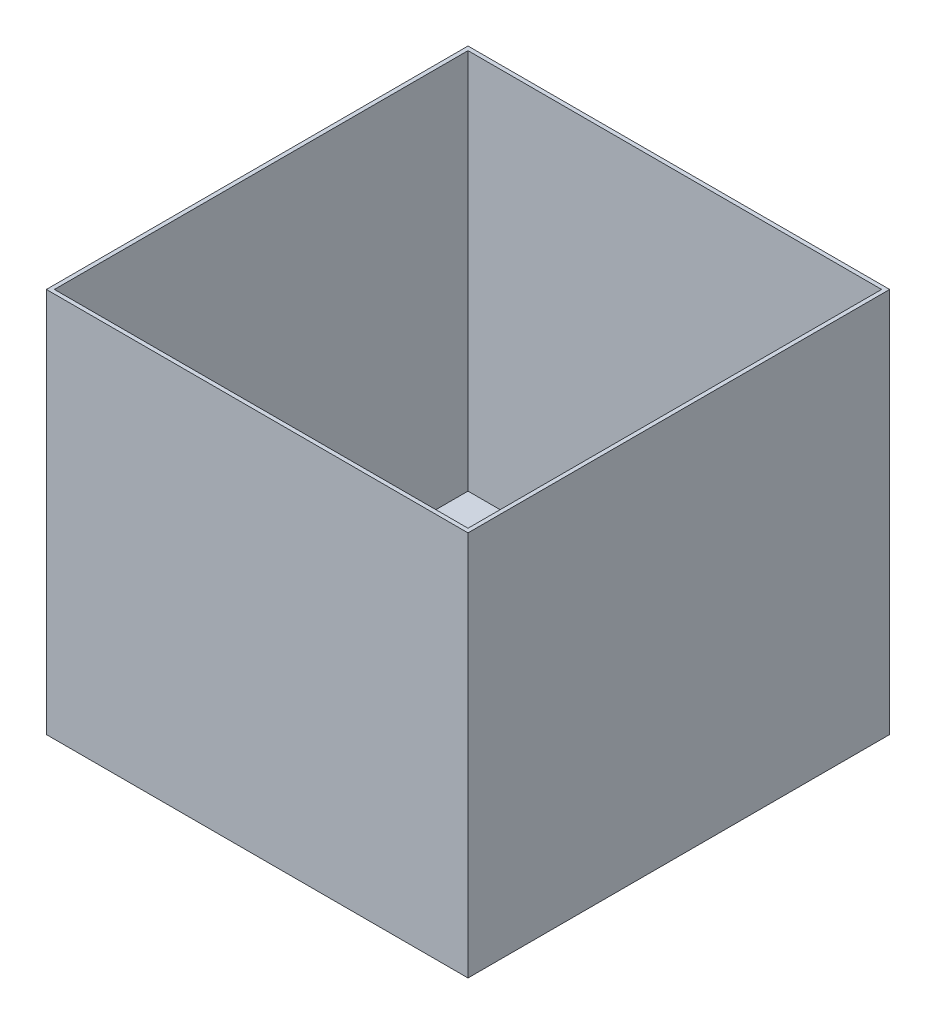
ISO-10303-21;
HEADER;
FILE_DESCRIPTION(('STEP AP214'),'2;1');
FILE_NAME('part.step','',(''),(''),'','','');
FILE_SCHEMA(('AUTOMOTIVE_DESIGN { 1 0 10303 214 1 1 1 1 }'));
ENDSEC;
DATA;
#1=APPLICATION_CONTEXT('core data for automotive mechanical design processes');
#2=APPLICATION_PROTOCOL_DEFINITION('international standard','automotive_design',2000,#1);
#3=PRODUCT_CONTEXT('',#1,'mechanical');
#4=PRODUCT('Part','Part','',(#3));
#5=PRODUCT_RELATED_PRODUCT_CATEGORY('part','',(#4));
#6=PRODUCT_DEFINITION_FORMATION('','',#4);
#7=PRODUCT_DEFINITION_CONTEXT('part definition',#1,'design');
#8=PRODUCT_DEFINITION('design','',#6,#7);
#9=PRODUCT_DEFINITION_SHAPE('','',#8);
#10=(LENGTH_UNIT() NAMED_UNIT(*) SI_UNIT(.MILLI.,.METRE.));
#11=(NAMED_UNIT(*) PLANE_ANGLE_UNIT() SI_UNIT($,.RADIAN.));
#12=(NAMED_UNIT(*) SI_UNIT($,.STERADIAN.) SOLID_ANGLE_UNIT());
#13=UNCERTAINTY_MEASURE_WITH_UNIT(LENGTH_MEASURE(1.E-05),#10,'distance_accuracy_value','');
#14=(GEOMETRIC_REPRESENTATION_CONTEXT(3) GLOBAL_UNCERTAINTY_ASSIGNED_CONTEXT((#13)) GLOBAL_UNIT_ASSIGNED_CONTEXT((#10,
#11,#12)) REPRESENTATION_CONTEXT('',''));
#15=CARTESIAN_POINT('',(0.,0.,0.));
#16=DIRECTION('',(0.,0.,1.));
#17=DIRECTION('',(1.,0.,0.));
#18=AXIS2_PLACEMENT_3D('',#15,#16,#17);
#19=CARTESIAN_POINT('',(-105.,96.,105.));
#20=DIRECTION('',(1.,0.,0.));
#21=DIRECTION('',(0.,1.,0.));
#22=AXIS2_PLACEMENT_3D('',#19,#20,#21);
#23=PLANE('',#22);
#24=DIRECTION('',(0.,-1.,0.));
#25=VECTOR('',#24,1.);
#26=CARTESIAN_POINT('',(-105.,96.,-105.));
#27=LINE('',#26,#25);
#28=CARTESIAN_POINT('',(-105.,96.,-105.));
#29=VERTEX_POINT('',#28);
#30=CARTESIAN_POINT('',(-105.,-96.,-105.));
#31=VERTEX_POINT('',#30);
#32=EDGE_CURVE('E145',#29,#31,#27,.T.);
#33=ORIENTED_EDGE('',*,*,#32,.T.);
#34=DIRECTION('',(0.,0.,-1.));
#35=VECTOR('',#34,1.);
#36=CARTESIAN_POINT('',(-105.,-96.,105.));
#37=LINE('',#36,#35);
#38=CARTESIAN_POINT('',(-105.,-96.,105.));
#39=VERTEX_POINT('',#38);
#40=EDGE_CURVE('E12',#39,#31,#37,.T.);
#41=ORIENTED_EDGE('',*,*,#40,.F.);
#42=DIRECTION('',(0.,-1.,0.));
#43=VECTOR('',#42,1.);
#44=CARTESIAN_POINT('',(-105.,96.,105.));
#45=LINE('',#44,#43);
#46=CARTESIAN_POINT('',(-105.,96.,105.));
#47=VERTEX_POINT('',#46);
#48=EDGE_CURVE('E147',#47,#39,#45,.T.);
#49=ORIENTED_EDGE('',*,*,#48,.F.);
#50=DIRECTION('',(0.,0.,-1.));
#51=VECTOR('',#50,1.);
#52=CARTESIAN_POINT('',(-105.,96.,105.));
#53=LINE('',#52,#51);
#54=EDGE_CURVE('E153',#47,#29,#53,.T.);
#55=ORIENTED_EDGE('',*,*,#54,.T.);
#56=EDGE_LOOP('',(#33,#41,#49,#55));
#57=FACE_BOUND('',#56,.T.);
#58=ADVANCED_FACE('F39',(#57),#23,.F.);
#59=CARTESIAN_POINT('',(105.,-96.,105.));
#60=DIRECTION('',(0.,1.,0.));
#61=DIRECTION('',(-1.,0.,0.));
#62=AXIS2_PLACEMENT_3D('',#59,#60,#61);
#63=PLANE('',#62);
#64=DIRECTION('',(1.,0.,0.));
#65=VECTOR('',#64,1.);
#66=CARTESIAN_POINT('',(105.,-96.,-105.));
#67=LINE('',#66,#65);
#68=CARTESIAN_POINT('',(105.,-96.,-105.));
#69=VERTEX_POINT('',#68);
#70=EDGE_CURVE('E156',#31,#69,#67,.T.);
#71=ORIENTED_EDGE('',*,*,#70,.T.);
#72=DIRECTION('',(0.,0.,-1.));
#73=VECTOR('',#72,1.);
#74=CARTESIAN_POINT('',(105.,-96.,105.));
#75=LINE('',#74,#73);
#76=CARTESIAN_POINT('',(105.,-96.,105.));
#77=VERTEX_POINT('',#76);
#78=EDGE_CURVE('E46',#77,#69,#75,.T.);
#79=ORIENTED_EDGE('',*,*,#78,.F.);
#80=DIRECTION('',(1.,0.,0.));
#81=VECTOR('',#80,1.);
#82=CARTESIAN_POINT('',(105.,-96.,105.));
#83=LINE('',#82,#81);
#84=EDGE_CURVE('E90',#39,#77,#83,.T.);
#85=ORIENTED_EDGE('',*,*,#84,.F.);
#86=ORIENTED_EDGE('',*,*,#40,.T.);
#87=EDGE_LOOP('',(#71,#79,#85,#86));
#88=FACE_BOUND('',#87,.T.);
#89=ADVANCED_FACE('F183',(#88),#63,.F.);
#90=CARTESIAN_POINT('',(105.,96.,105.));
#91=DIRECTION('',(-1.,0.,0.));
#92=DIRECTION('',(0.,-1.,0.));
#93=AXIS2_PLACEMENT_3D('',#90,#91,#92);
#94=PLANE('',#93);
#95=DIRECTION('',(0.,1.,0.));
#96=VECTOR('',#95,1.);
#97=CARTESIAN_POINT('',(105.,96.,-105.));
#98=LINE('',#97,#96);
#99=CARTESIAN_POINT('',(105.,96.,-105.));
#100=VERTEX_POINT('',#99);
#101=EDGE_CURVE('E158',#69,#100,#98,.T.);
#102=ORIENTED_EDGE('',*,*,#101,.T.);
#103=DIRECTION('',(0.,0.,-1.));
#104=VECTOR('',#103,1.);
#105=CARTESIAN_POINT('',(105.,96.,105.));
#106=LINE('',#105,#104);
#107=CARTESIAN_POINT('',(105.,96.,105.));
#108=VERTEX_POINT('',#107);
#109=EDGE_CURVE('E162',#108,#100,#106,.T.);
#110=ORIENTED_EDGE('',*,*,#109,.F.);
#111=DIRECTION('',(0.,1.,0.));
#112=VECTOR('',#111,1.);
#113=CARTESIAN_POINT('',(105.,96.,105.));
#114=LINE('',#113,#112);
#115=EDGE_CURVE('E150',#77,#108,#114,.T.);
#116=ORIENTED_EDGE('',*,*,#115,.F.);
#117=ORIENTED_EDGE('',*,*,#78,.T.);
#118=EDGE_LOOP('',(#102,#110,#116,#117));
#119=FACE_BOUND('',#118,.T.);
#120=ADVANCED_FACE('F167',(#119),#94,.F.);
#121=CARTESIAN_POINT('',(105.,96.,105.));
#122=DIRECTION('',(0.,-1.,0.));
#123=DIRECTION('',(1.,0.,0.));
#124=AXIS2_PLACEMENT_3D('',#121,#122,#123);
#125=PLANE('',#124);
#126=DIRECTION('',(-1.,0.,0.));
#127=VECTOR('',#126,1.);
#128=CARTESIAN_POINT('',(103.,96.,-103.));
#129=LINE('',#128,#127);
#130=CARTESIAN_POINT('',(103.,96.,-103.));
#131=VERTEX_POINT('',#130);
#132=CARTESIAN_POINT('',(-103.,96.,-103.));
#133=VERTEX_POINT('',#132);
#134=EDGE_CURVE('E128',#131,#133,#129,.T.);
#135=ORIENTED_EDGE('',*,*,#134,.F.);
#136=DIRECTION('',(0.,0.,-1.));
#137=VECTOR('',#136,1.);
#138=CARTESIAN_POINT('',(103.,96.,103.));
#139=LINE('',#138,#137);
#140=CARTESIAN_POINT('',(103.,96.,103.));
#141=VERTEX_POINT('',#140);
#142=EDGE_CURVE('E53',#141,#131,#139,.T.);
#143=ORIENTED_EDGE('',*,*,#142,.F.);
#144=DIRECTION('',(1.,0.,0.));
#145=VECTOR('',#144,1.);
#146=CARTESIAN_POINT('',(-103.,96.,103.));
#147=LINE('',#146,#145);
#148=CARTESIAN_POINT('',(-103.,96.,103.));
#149=VERTEX_POINT('',#148);
#150=EDGE_CURVE('E134',#149,#141,#147,.T.);
#151=ORIENTED_EDGE('',*,*,#150,.F.);
#152=DIRECTION('',(0.,0.,1.));
#153=VECTOR('',#152,1.);
#154=CARTESIAN_POINT('',(-103.,96.,-103.));
#155=LINE('',#154,#153);
#156=EDGE_CURVE('E118',#133,#149,#155,.T.);
#157=ORIENTED_EDGE('',*,*,#156,.F.);
#158=EDGE_LOOP('',(#135,#143,#151,#157));
#159=FACE_BOUND('',#158,.T.);
#160=DIRECTION('',(-1.,0.,0.));
#161=VECTOR('',#160,1.);
#162=CARTESIAN_POINT('',(105.,96.,-105.));
#163=LINE('',#162,#161);
#164=EDGE_CURVE('E83',#100,#29,#163,.T.);
#165=ORIENTED_EDGE('',*,*,#164,.T.);
#166=ORIENTED_EDGE('',*,*,#54,.F.);
#167=DIRECTION('',(-1.,0.,0.));
#168=VECTOR('',#167,1.);
#169=CARTESIAN_POINT('',(105.,96.,105.));
#170=LINE('',#169,#168);
#171=EDGE_CURVE('E62',#108,#47,#170,.T.);
#172=ORIENTED_EDGE('',*,*,#171,.F.);
#173=ORIENTED_EDGE('',*,*,#109,.T.);
#174=EDGE_LOOP('',(#165,#166,#172,#173));
#175=FACE_BOUND('',#174,.T.);
#176=ADVANCED_FACE('F132',(#159,#175),#125,.F.);
#177=CARTESIAN_POINT('',(0.,0.,105.));
#178=DIRECTION('',(0.,0.,-1.));
#179=DIRECTION('',(-1.,0.,0.));
#180=AXIS2_PLACEMENT_3D('',#177,#178,#179);
#181=PLANE('',#180);
#182=ORIENTED_EDGE('',*,*,#48,.T.);
#183=ORIENTED_EDGE('',*,*,#84,.T.);
#184=ORIENTED_EDGE('',*,*,#115,.T.);
#185=ORIENTED_EDGE('',*,*,#171,.T.);
#186=EDGE_LOOP('',(#182,#183,#184,#185));
#187=FACE_BOUND('',#186,.T.);
#188=ADVANCED_FACE('F176',(#187),#181,.F.);
#189=CARTESIAN_POINT('',(0.,0.,-105.));
#190=DIRECTION('',(0.,0.,-1.));
#191=DIRECTION('',(-1.,0.,0.));
#192=AXIS2_PLACEMENT_3D('',#189,#190,#191);
#193=PLANE('',#192);
#194=ORIENTED_EDGE('',*,*,#32,.F.);
#195=ORIENTED_EDGE('',*,*,#164,.F.);
#196=ORIENTED_EDGE('',*,*,#101,.F.);
#197=ORIENTED_EDGE('',*,*,#70,.F.);
#198=EDGE_LOOP('',(#194,#195,#196,#197));
#199=FACE_BOUND('',#198,.T.);
#200=ADVANCED_FACE('F171',(#199),#193,.T.);
#201=CARTESIAN_POINT('',(103.,-387.327993848858,103.));
#202=DIRECTION('',(1.,0.,0.));
#203=DIRECTION('',(0.,0.,-1.));
#204=AXIS2_PLACEMENT_3D('',#201,#202,#203);
#205=PLANE('',#204);
#206=DIRECTION('',(0.,0.,1.));
#207=VECTOR('',#206,1.);
#208=CARTESIAN_POINT('',(103.,-94.,103.));
#209=LINE('',#208,#207);
#210=CARTESIAN_POINT('',(103.,-94.,-103.));
#211=VERTEX_POINT('',#210);
#212=CARTESIAN_POINT('',(103.,-94.,103.));
#213=VERTEX_POINT('',#212);
#214=EDGE_CURVE('E146',#211,#213,#209,.T.);
#215=ORIENTED_EDGE('',*,*,#214,.T.);
#216=DIRECTION('',(0.,1.,0.));
#217=VECTOR('',#216,1.);
#218=CARTESIAN_POINT('',(103.,-387.327993848858,103.));
#219=LINE('',#218,#217);
#220=EDGE_CURVE('E139',#213,#141,#219,.T.);
#221=ORIENTED_EDGE('',*,*,#220,.T.);
#222=ORIENTED_EDGE('',*,*,#142,.T.);
#223=DIRECTION('',(0.,1.,0.));
#224=VECTOR('',#223,1.);
#225=CARTESIAN_POINT('',(103.,-387.327993848858,-103.));
#226=LINE('',#225,#224);
#227=EDGE_CURVE('E125',#211,#131,#226,.T.);
#228=ORIENTED_EDGE('',*,*,#227,.F.);
#229=EDGE_LOOP('',(#215,#221,#222,#228));
#230=FACE_BOUND('',#229,.T.);
#231=ADVANCED_FACE('F213',(#230),#205,.F.);
#232=CARTESIAN_POINT('',(-103.,-387.327993848858,103.));
#233=DIRECTION('',(0.,0.,1.));
#234=DIRECTION('',(1.,0.,0.));
#235=AXIS2_PLACEMENT_3D('',#232,#233,#234);
#236=PLANE('',#235);
#237=DIRECTION('',(-1.,0.,0.));
#238=VECTOR('',#237,1.);
#239=CARTESIAN_POINT('',(-103.,-94.,103.));
#240=LINE('',#239,#238);
#241=CARTESIAN_POINT('',(-103.,-94.,103.));
#242=VERTEX_POINT('',#241);
#243=EDGE_CURVE('E292',#213,#242,#240,.T.);
#244=ORIENTED_EDGE('',*,*,#243,.T.);
#245=DIRECTION('',(0.,1.,0.));
#246=VECTOR('',#245,1.);
#247=CARTESIAN_POINT('',(-103.,-387.327993848858,103.));
#248=LINE('',#247,#246);
#249=EDGE_CURVE('E124',#242,#149,#248,.T.);
#250=ORIENTED_EDGE('',*,*,#249,.T.);
#251=ORIENTED_EDGE('',*,*,#150,.T.);
#252=ORIENTED_EDGE('',*,*,#220,.F.);
#253=EDGE_LOOP('',(#244,#250,#251,#252));
#254=FACE_BOUND('',#253,.T.);
#255=ADVANCED_FACE('F227',(#254),#236,.F.);
#256=CARTESIAN_POINT('',(-103.,-387.327993848858,-103.));
#257=DIRECTION('',(-1.,0.,0.));
#258=DIRECTION('',(0.,0.,1.));
#259=AXIS2_PLACEMENT_3D('',#256,#257,#258);
#260=PLANE('',#259);
#261=DIRECTION('',(0.,0.,-1.));
#262=VECTOR('',#261,1.);
#263=CARTESIAN_POINT('',(-103.,-94.,-103.));
#264=LINE('',#263,#262);
#265=CARTESIAN_POINT('',(-103.,-94.,-103.));
#266=VERTEX_POINT('',#265);
#267=EDGE_CURVE('E121',#242,#266,#264,.T.);
#268=ORIENTED_EDGE('',*,*,#267,.T.);
#269=DIRECTION('',(0.,1.,0.));
#270=VECTOR('',#269,1.);
#271=CARTESIAN_POINT('',(-103.,-387.327993848858,-103.));
#272=LINE('',#271,#270);
#273=EDGE_CURVE('E113',#266,#133,#272,.T.);
#274=ORIENTED_EDGE('',*,*,#273,.T.);
#275=ORIENTED_EDGE('',*,*,#156,.T.);
#276=ORIENTED_EDGE('',*,*,#249,.F.);
#277=EDGE_LOOP('',(#268,#274,#275,#276));
#278=FACE_BOUND('',#277,.T.);
#279=ADVANCED_FACE('F115',(#278),#260,.F.);
#280=CARTESIAN_POINT('',(103.,-387.327993848858,-103.));
#281=DIRECTION('',(0.,0.,-1.));
#282=DIRECTION('',(-1.,0.,0.));
#283=AXIS2_PLACEMENT_3D('',#280,#281,#282);
#284=PLANE('',#283);
#285=DIRECTION('',(1.,0.,0.));
#286=VECTOR('',#285,1.);
#287=CARTESIAN_POINT('',(103.,-94.,-103.));
#288=LINE('',#287,#286);
#289=EDGE_CURVE('E143',#266,#211,#288,.T.);
#290=ORIENTED_EDGE('',*,*,#289,.T.);
#291=ORIENTED_EDGE('',*,*,#227,.T.);
#292=ORIENTED_EDGE('',*,*,#134,.T.);
#293=ORIENTED_EDGE('',*,*,#273,.F.);
#294=EDGE_LOOP('',(#290,#291,#292,#293));
#295=FACE_BOUND('',#294,.T.);
#296=ADVANCED_FACE('F129',(#295),#284,.F.);
#297=CARTESIAN_POINT('',(105.,-94.,105.));
#298=DIRECTION('',(0.,1.,0.));
#299=DIRECTION('',(-1.,0.,0.));
#300=AXIS2_PLACEMENT_3D('',#297,#298,#299);
#301=PLANE('',#300);
#302=ORIENTED_EDGE('',*,*,#214,.F.);
#303=ORIENTED_EDGE('',*,*,#289,.F.);
#304=ORIENTED_EDGE('',*,*,#267,.F.);
#305=ORIENTED_EDGE('',*,*,#243,.F.);
#306=EDGE_LOOP('',(#302,#303,#304,#305));
#307=FACE_BOUND('',#306,.T.);
#308=ADVANCED_FACE('F256',(#307),#301,.T.);
#309=CLOSED_SHELL('',(#58,#89,#120,#176,#188,#200,#231,#255,#279,#296,#308));
#310=MANIFOLD_SOLID_BREP('B2',#309);
#311=ADVANCED_BREP_SHAPE_REPRESENTATION('',(#18,#310),#14);
#312=SHAPE_DEFINITION_REPRESENTATION(#9,#311);
ENDSEC;
END-ISO-10303-21;
